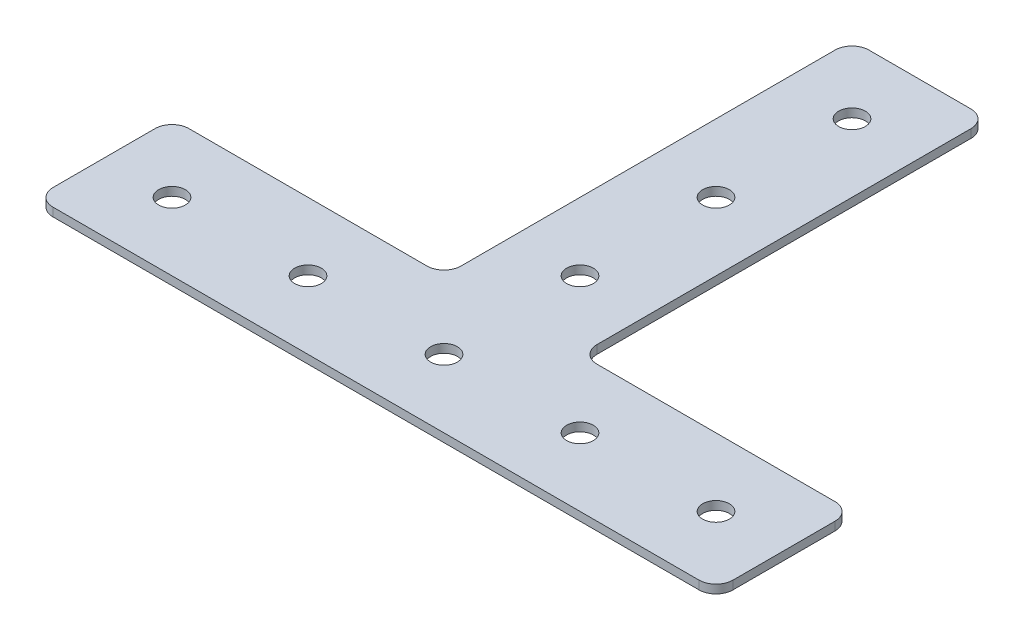
ISO-10303-21;
HEADER;
FILE_DESCRIPTION(('STEP AP214'),'2;1');
FILE_NAME('part.step','',(''),(''),'','','');
FILE_SCHEMA(('AUTOMOTIVE_DESIGN { 1 0 10303 214 1 1 1 1 }'));
ENDSEC;
DATA;
#1=APPLICATION_CONTEXT('core data for automotive mechanical design processes');
#2=APPLICATION_PROTOCOL_DEFINITION('international standard','automotive_design',2000,#1);
#3=PRODUCT_CONTEXT('',#1,'mechanical');
#4=PRODUCT('Part','Part','',(#3));
#5=PRODUCT_RELATED_PRODUCT_CATEGORY('part','',(#4));
#6=PRODUCT_DEFINITION_FORMATION('','',#4);
#7=PRODUCT_DEFINITION_CONTEXT('part definition',#1,'design');
#8=PRODUCT_DEFINITION('design','',#6,#7);
#9=PRODUCT_DEFINITION_SHAPE('','',#8);
#10=(LENGTH_UNIT() NAMED_UNIT(*) SI_UNIT(.MILLI.,.METRE.));
#11=(NAMED_UNIT(*) PLANE_ANGLE_UNIT() SI_UNIT($,.RADIAN.));
#12=(NAMED_UNIT(*) SI_UNIT($,.STERADIAN.) SOLID_ANGLE_UNIT());
#13=UNCERTAINTY_MEASURE_WITH_UNIT(LENGTH_MEASURE(1.E-05),#10,'distance_accuracy_value','');
#14=(GEOMETRIC_REPRESENTATION_CONTEXT(3) GLOBAL_UNCERTAINTY_ASSIGNED_CONTEXT((#13)) GLOBAL_UNIT_ASSIGNED_CONTEXT((#10,
#11,#12)) REPRESENTATION_CONTEXT('',''));
#15=CARTESIAN_POINT('',(0.,0.,0.));
#16=DIRECTION('',(0.,0.,1.));
#17=DIRECTION('',(1.,0.,0.));
#18=AXIS2_PLACEMENT_3D('',#15,#16,#17);
#19=CARTESIAN_POINT('',(63.5,1.5875,12.7));
#20=DIRECTION('',(-1.,0.,0.));
#21=DIRECTION('',(0.,0.,1.));
#22=AXIS2_PLACEMENT_3D('',#19,#20,#21);
#23=PLANE('',#22);
#24=DIRECTION('',(0.,0.,-1.));
#25=VECTOR('',#24,1.);
#26=CARTESIAN_POINT('',(63.5,1.5875,12.7));
#27=LINE('',#26,#25);
#28=CARTESIAN_POINT('',(63.5,1.5875,9.525));
#29=VERTEX_POINT('',#28);
#30=CARTESIAN_POINT('',(63.5,1.5875,-9.525));
#31=VERTEX_POINT('',#30);
#32=EDGE_CURVE('E170',#29,#31,#27,.T.);
#33=ORIENTED_EDGE('',*,*,#32,.F.);
#34=DIRECTION('',(0.,-1.,0.));
#35=VECTOR('',#34,1.);
#36=CARTESIAN_POINT('',(63.5,1.5875,9.525));
#37=LINE('',#36,#35);
#38=CARTESIAN_POINT('',(63.5,0.,9.525));
#39=VERTEX_POINT('',#38);
#40=EDGE_CURVE('E155',#29,#39,#37,.T.);
#41=ORIENTED_EDGE('',*,*,#40,.T.);
#42=DIRECTION('',(0.,0.,-1.));
#43=VECTOR('',#42,1.);
#44=CARTESIAN_POINT('',(63.5,0.,12.7));
#45=LINE('',#44,#43);
#46=CARTESIAN_POINT('',(63.5,0.,-9.525));
#47=VERTEX_POINT('',#46);
#48=EDGE_CURVE('E167',#39,#47,#45,.T.);
#49=ORIENTED_EDGE('',*,*,#48,.T.);
#50=DIRECTION('',(0.,-1.,0.));
#51=VECTOR('',#50,1.);
#52=CARTESIAN_POINT('',(63.5,1.5875,-9.525));
#53=LINE('',#52,#51);
#54=EDGE_CURVE('E172',#47,#31,#53,.F.);
#55=ORIENTED_EDGE('',*,*,#54,.T.);
#56=EDGE_LOOP('',(#33,#41,#49,#55));
#57=FACE_BOUND('',#56,.T.);
#58=ADVANCED_FACE('F37',(#57),#23,.F.);
#59=CARTESIAN_POINT('',(12.7,1.5875,-12.7));
#60=DIRECTION('',(0.,0.,1.));
#61=DIRECTION('',(1.,0.,0.));
#62=AXIS2_PLACEMENT_3D('',#59,#60,#61);
#63=PLANE('',#62);
#64=DIRECTION('',(-1.,0.,0.));
#65=VECTOR('',#64,1.);
#66=CARTESIAN_POINT('',(12.7,0.,-12.7));
#67=LINE('',#66,#65);
#68=CARTESIAN_POINT('',(60.325,0.,-12.7));
#69=VERTEX_POINT('',#68);
#70=CARTESIAN_POINT('',(15.875,0.,-12.7));
#71=VERTEX_POINT('',#70);
#72=EDGE_CURVE('E177',#69,#71,#67,.T.);
#73=ORIENTED_EDGE('',*,*,#72,.T.);
#74=DIRECTION('',(0.,-1.,0.));
#75=VECTOR('',#74,1.);
#76=CARTESIAN_POINT('',(15.875,1.5875,-12.7));
#77=LINE('',#76,#75);
#78=CARTESIAN_POINT('',(15.875,1.5875,-12.7));
#79=VERTEX_POINT('',#78);
#80=EDGE_CURVE('E254',#71,#79,#77,.F.);
#81=ORIENTED_EDGE('',*,*,#80,.T.);
#82=DIRECTION('',(-1.,0.,0.));
#83=VECTOR('',#82,1.);
#84=CARTESIAN_POINT('',(12.7,1.5875,-12.7));
#85=LINE('',#84,#83);
#86=CARTESIAN_POINT('',(60.325,1.5875,-12.7));
#87=VERTEX_POINT('',#86);
#88=EDGE_CURVE('E276',#87,#79,#85,.T.);
#89=ORIENTED_EDGE('',*,*,#88,.F.);
#90=DIRECTION('',(0.,-1.,0.));
#91=VECTOR('',#90,1.);
#92=CARTESIAN_POINT('',(60.325,1.5875,-12.7));
#93=LINE('',#92,#91);
#94=EDGE_CURVE('E251',#87,#69,#93,.T.);
#95=ORIENTED_EDGE('',*,*,#94,.T.);
#96=EDGE_LOOP('',(#73,#81,#89,#95));
#97=FACE_BOUND('',#96,.T.);
#98=ADVANCED_FACE('F264',(#97),#63,.F.);
#99=CARTESIAN_POINT('',(12.7,1.5875,-88.9));
#100=DIRECTION('',(-1.,0.,0.));
#101=DIRECTION('',(0.,0.,1.));
#102=AXIS2_PLACEMENT_3D('',#99,#100,#101);
#103=PLANE('',#102);
#104=DIRECTION('',(0.,0.,-1.));
#105=VECTOR('',#104,1.);
#106=CARTESIAN_POINT('',(12.7,0.,-88.9));
#107=LINE('',#106,#105);
#108=CARTESIAN_POINT('',(12.7,0.,-15.875));
#109=VERTEX_POINT('',#108);
#110=CARTESIAN_POINT('',(12.7,0.,-85.725));
#111=VERTEX_POINT('',#110);
#112=EDGE_CURVE('E181',#109,#111,#107,.T.);
#113=ORIENTED_EDGE('',*,*,#112,.T.);
#114=DIRECTION('',(0.,-1.,0.));
#115=VECTOR('',#114,1.);
#116=CARTESIAN_POINT('',(12.7,1.5875,-85.725));
#117=LINE('',#116,#115);
#118=CARTESIAN_POINT('',(12.7,1.5875,-85.725));
#119=VERTEX_POINT('',#118);
#120=EDGE_CURVE('E249',#111,#119,#117,.F.);
#121=ORIENTED_EDGE('',*,*,#120,.T.);
#122=DIRECTION('',(0.,0.,-1.));
#123=VECTOR('',#122,1.);
#124=CARTESIAN_POINT('',(12.7,1.5875,-88.9));
#125=LINE('',#124,#123);
#126=CARTESIAN_POINT('',(12.7,1.5875,-15.875));
#127=VERTEX_POINT('',#126);
#128=EDGE_CURVE('E274',#127,#119,#125,.T.);
#129=ORIENTED_EDGE('',*,*,#128,.F.);
#130=DIRECTION('',(0.,-1.,0.));
#131=VECTOR('',#130,1.);
#132=CARTESIAN_POINT('',(12.7,0.,-15.875));
#133=LINE('',#132,#131);
#134=EDGE_CURVE('E246',#127,#109,#133,.T.);
#135=ORIENTED_EDGE('',*,*,#134,.T.);
#136=EDGE_LOOP('',(#113,#121,#129,#135));
#137=FACE_BOUND('',#136,.T.);
#138=ADVANCED_FACE('F278',(#137),#103,.F.);
#139=CARTESIAN_POINT('',(-12.7,1.5875,-88.9));
#140=DIRECTION('',(0.,0.,1.));
#141=DIRECTION('',(1.,0.,0.));
#142=AXIS2_PLACEMENT_3D('',#139,#140,#141);
#143=PLANE('',#142);
#144=DIRECTION('',(-1.,0.,0.));
#145=VECTOR('',#144,1.);
#146=CARTESIAN_POINT('',(-12.7,0.,-88.9));
#147=LINE('',#146,#145);
#148=CARTESIAN_POINT('',(9.52499999999999,0.,-88.9));
#149=VERTEX_POINT('',#148);
#150=CARTESIAN_POINT('',(-9.52500000000001,0.,-88.9));
#151=VERTEX_POINT('',#150);
#152=EDGE_CURVE('E192',#149,#151,#147,.T.);
#153=ORIENTED_EDGE('',*,*,#152,.T.);
#154=DIRECTION('',(0.,-1.,0.));
#155=VECTOR('',#154,1.);
#156=CARTESIAN_POINT('',(-9.52500000000001,1.5875,-88.9));
#157=LINE('',#156,#155);
#158=CARTESIAN_POINT('',(-9.52500000000001,1.5875,-88.9));
#159=VERTEX_POINT('',#158);
#160=EDGE_CURVE('E244',#151,#159,#157,.F.);
#161=ORIENTED_EDGE('',*,*,#160,.T.);
#162=DIRECTION('',(-1.,0.,0.));
#163=VECTOR('',#162,1.);
#164=CARTESIAN_POINT('',(-12.7,1.5875,-88.9));
#165=LINE('',#164,#163);
#166=CARTESIAN_POINT('',(9.52499999999999,1.5875,-88.9));
#167=VERTEX_POINT('',#166);
#168=EDGE_CURVE('E280',#167,#159,#165,.T.);
#169=ORIENTED_EDGE('',*,*,#168,.F.);
#170=DIRECTION('',(0.,-1.,0.));
#171=VECTOR('',#170,1.);
#172=CARTESIAN_POINT('',(9.52499999999999,1.5875,-88.9));
#173=LINE('',#172,#171);
#174=EDGE_CURVE('E241',#167,#149,#173,.T.);
#175=ORIENTED_EDGE('',*,*,#174,.T.);
#176=EDGE_LOOP('',(#153,#161,#169,#175));
#177=FACE_BOUND('',#176,.T.);
#178=ADVANCED_FACE('F324',(#177),#143,.F.);
#179=CARTESIAN_POINT('',(-12.7,1.5875,-88.9));
#180=DIRECTION('',(1.,0.,0.));
#181=DIRECTION('',(0.,0.,-1.));
#182=AXIS2_PLACEMENT_3D('',#179,#180,#181);
#183=PLANE('',#182);
#184=DIRECTION('',(0.,0.,1.));
#185=VECTOR('',#184,1.);
#186=CARTESIAN_POINT('',(-12.7,0.,-88.9));
#187=LINE('',#186,#185);
#188=CARTESIAN_POINT('',(-12.7,0.,-85.725));
#189=VERTEX_POINT('',#188);
#190=CARTESIAN_POINT('',(-12.7,0.,-15.875));
#191=VERTEX_POINT('',#190);
#192=EDGE_CURVE('E195',#189,#191,#187,.T.);
#193=ORIENTED_EDGE('',*,*,#192,.T.);
#194=DIRECTION('',(0.,-1.,0.));
#195=VECTOR('',#194,1.);
#196=CARTESIAN_POINT('',(-12.7,1.5875,-15.875));
#197=LINE('',#196,#195);
#198=CARTESIAN_POINT('',(-12.7,1.5875,-15.875));
#199=VERTEX_POINT('',#198);
#200=EDGE_CURVE('E239',#191,#199,#197,.F.);
#201=ORIENTED_EDGE('',*,*,#200,.T.);
#202=DIRECTION('',(0.,0.,1.));
#203=VECTOR('',#202,1.);
#204=CARTESIAN_POINT('',(-12.7,1.5875,-88.9));
#205=LINE('',#204,#203);
#206=CARTESIAN_POINT('',(-12.7,1.5875,-85.725));
#207=VERTEX_POINT('',#206);
#208=EDGE_CURVE('E283',#207,#199,#205,.T.);
#209=ORIENTED_EDGE('',*,*,#208,.F.);
#210=DIRECTION('',(0.,-1.,0.));
#211=VECTOR('',#210,1.);
#212=CARTESIAN_POINT('',(-12.7,1.5875,-85.725));
#213=LINE('',#212,#211);
#214=EDGE_CURVE('E236',#207,#189,#213,.T.);
#215=ORIENTED_EDGE('',*,*,#214,.T.);
#216=EDGE_LOOP('',(#193,#201,#209,#215));
#217=FACE_BOUND('',#216,.T.);
#218=ADVANCED_FACE('F315',(#217),#183,.F.);
#219=CARTESIAN_POINT('',(-63.5,1.5875,-12.7));
#220=DIRECTION('',(0.,0.,1.));
#221=DIRECTION('',(1.,0.,0.));
#222=AXIS2_PLACEMENT_3D('',#219,#220,#221);
#223=PLANE('',#222);
#224=DIRECTION('',(-1.,0.,0.));
#225=VECTOR('',#224,1.);
#226=CARTESIAN_POINT('',(-63.5,1.5875,-12.7));
#227=LINE('',#226,#225);
#228=CARTESIAN_POINT('',(-15.875,1.5875,-12.7));
#229=VERTEX_POINT('',#228);
#230=CARTESIAN_POINT('',(-60.325,1.5875,-12.7));
#231=VERTEX_POINT('',#230);
#232=EDGE_CURVE('E290',#229,#231,#227,.T.);
#233=ORIENTED_EDGE('',*,*,#232,.F.);
#234=DIRECTION('',(0.,-1.,0.));
#235=VECTOR('',#234,1.);
#236=CARTESIAN_POINT('',(-15.875,0.,-12.7));
#237=LINE('',#236,#235);
#238=CARTESIAN_POINT('',(-15.875,0.,-12.7));
#239=VERTEX_POINT('',#238);
#240=EDGE_CURVE('E233',#229,#239,#237,.T.);
#241=ORIENTED_EDGE('',*,*,#240,.T.);
#242=DIRECTION('',(-1.,0.,0.));
#243=VECTOR('',#242,1.);
#244=CARTESIAN_POINT('',(-63.5,0.,-12.7));
#245=LINE('',#244,#243);
#246=CARTESIAN_POINT('',(-60.325,0.,-12.7));
#247=VERTEX_POINT('',#246);
#248=EDGE_CURVE('E198',#239,#247,#245,.T.);
#249=ORIENTED_EDGE('',*,*,#248,.T.);
#250=DIRECTION('',(0.,-1.,0.));
#251=VECTOR('',#250,1.);
#252=CARTESIAN_POINT('',(-60.325,1.5875,-12.7));
#253=LINE('',#252,#251);
#254=EDGE_CURVE('E231',#247,#231,#253,.F.);
#255=ORIENTED_EDGE('',*,*,#254,.T.);
#256=EDGE_LOOP('',(#233,#241,#249,#255));
#257=FACE_BOUND('',#256,.T.);
#258=ADVANCED_FACE('F307',(#257),#223,.F.);
#259=CARTESIAN_POINT('',(-63.5,1.5875,12.7));
#260=DIRECTION('',(1.,0.,0.));
#261=DIRECTION('',(0.,0.,-1.));
#262=AXIS2_PLACEMENT_3D('',#259,#260,#261);
#263=PLANE('',#262);
#264=DIRECTION('',(0.,0.,1.));
#265=VECTOR('',#264,1.);
#266=CARTESIAN_POINT('',(-63.5,0.,12.7));
#267=LINE('',#266,#265);
#268=CARTESIAN_POINT('',(-63.5,0.,-9.525));
#269=VERTEX_POINT('',#268);
#270=CARTESIAN_POINT('',(-63.5,0.,9.525));
#271=VERTEX_POINT('',#270);
#272=EDGE_CURVE('E201',#269,#271,#267,.T.);
#273=ORIENTED_EDGE('',*,*,#272,.T.);
#274=DIRECTION('',(0.,-1.,0.));
#275=VECTOR('',#274,1.);
#276=CARTESIAN_POINT('',(-63.5,1.5875,9.525));
#277=LINE('',#276,#275);
#278=CARTESIAN_POINT('',(-63.5,1.5875,9.525));
#279=VERTEX_POINT('',#278);
#280=EDGE_CURVE('E52',#271,#279,#277,.F.);
#281=ORIENTED_EDGE('',*,*,#280,.T.);
#282=DIRECTION('',(0.,0.,1.));
#283=VECTOR('',#282,1.);
#284=CARTESIAN_POINT('',(-63.5,1.5875,12.7));
#285=LINE('',#284,#283);
#286=CARTESIAN_POINT('',(-63.5,1.5875,-9.525));
#287=VERTEX_POINT('',#286);
#288=EDGE_CURVE('E291',#287,#279,#285,.T.);
#289=ORIENTED_EDGE('',*,*,#288,.F.);
#290=DIRECTION('',(0.,-1.,0.));
#291=VECTOR('',#290,1.);
#292=CARTESIAN_POINT('',(-63.5,1.5875,-9.525));
#293=LINE('',#292,#291);
#294=EDGE_CURVE('E227',#287,#269,#293,.T.);
#295=ORIENTED_EDGE('',*,*,#294,.T.);
#296=EDGE_LOOP('',(#273,#281,#289,#295));
#297=FACE_BOUND('',#296,.T.);
#298=ADVANCED_FACE('F300',(#297),#263,.F.);
#299=CARTESIAN_POINT('',(-63.5,1.5875,12.7));
#300=DIRECTION('',(0.,0.,-1.));
#301=DIRECTION('',(-1.,0.,0.));
#302=AXIS2_PLACEMENT_3D('',#299,#300,#301);
#303=PLANE('',#302);
#304=DIRECTION('',(1.,0.,0.));
#305=VECTOR('',#304,1.);
#306=CARTESIAN_POINT('',(-63.5,0.,12.7));
#307=LINE('',#306,#305);
#308=CARTESIAN_POINT('',(-60.325,0.,12.7));
#309=VERTEX_POINT('',#308);
#310=CARTESIAN_POINT('',(60.325,0.,12.7));
#311=VERTEX_POINT('',#310);
#312=EDGE_CURVE('E203',#309,#311,#307,.T.);
#313=ORIENTED_EDGE('',*,*,#312,.T.);
#314=DIRECTION('',(0.,-1.,0.));
#315=VECTOR('',#314,1.);
#316=CARTESIAN_POINT('',(60.325,1.5875,12.7));
#317=LINE('',#316,#315);
#318=CARTESIAN_POINT('',(60.325,1.5875,12.7));
#319=VERTEX_POINT('',#318);
#320=EDGE_CURVE('E156',#311,#319,#317,.F.);
#321=ORIENTED_EDGE('',*,*,#320,.T.);
#322=DIRECTION('',(1.,0.,0.));
#323=VECTOR('',#322,1.);
#324=CARTESIAN_POINT('',(-63.5,1.5875,12.7));
#325=LINE('',#324,#323);
#326=CARTESIAN_POINT('',(-60.325,1.5875,12.7));
#327=VERTEX_POINT('',#326);
#328=EDGE_CURVE('E187',#327,#319,#325,.T.);
#329=ORIENTED_EDGE('',*,*,#328,.F.);
#330=DIRECTION('',(0.,-1.,0.));
#331=VECTOR('',#330,1.);
#332=CARTESIAN_POINT('',(-60.325,1.5875,12.7));
#333=LINE('',#332,#331);
#334=EDGE_CURVE('E161',#327,#309,#333,.T.);
#335=ORIENTED_EDGE('',*,*,#334,.T.);
#336=EDGE_LOOP('',(#313,#321,#329,#335));
#337=FACE_BOUND('',#336,.T.);
#338=ADVANCED_FACE('F296',(#337),#303,.F.);
#339=CARTESIAN_POINT('',(0.,1.5875,0.));
#340=DIRECTION('',(0.,-1.,0.));
#341=DIRECTION('',(0.,0.,-1.));
#342=AXIS2_PLACEMENT_3D('',#339,#340,#341);
#343=PLANE('',#342);
#344=CARTESIAN_POINT('',(-25.4,1.5875,0.));
#345=DIRECTION('',(0.,-1.,0.));
#346=DIRECTION('',(0.,0.,-1.));
#347=AXIS2_PLACEMENT_3D('',#344,#345,#346);
#348=CIRCLE('',#347,2.4892);
#349=CARTESIAN_POINT('',(-25.4,1.5875,-2.4892));
#350=VERTEX_POINT('',#349);
#351=EDGE_CURVE('E178',#350,#350,#348,.T.);
#352=ORIENTED_EDGE('',*,*,#351,.T.);
#353=EDGE_LOOP('',(#352));
#354=FACE_BOUND('',#353,.T.);
#355=CARTESIAN_POINT('',(0.,1.5875,-76.2));
#356=DIRECTION('',(0.,-1.,0.));
#357=DIRECTION('',(0.,0.,-1.));
#358=AXIS2_PLACEMENT_3D('',#355,#356,#357);
#359=CIRCLE('',#358,2.4892);
#360=CARTESIAN_POINT('',(0.,1.5875,-78.6892));
#361=VERTEX_POINT('',#360);
#362=EDGE_CURVE('E184',#361,#361,#359,.T.);
#363=ORIENTED_EDGE('',*,*,#362,.T.);
#364=EDGE_LOOP('',(#363));
#365=FACE_BOUND('',#364,.T.);
#366=CARTESIAN_POINT('',(0.,1.5875,-50.8));
#367=DIRECTION('',(0.,-1.,0.));
#368=DIRECTION('',(0.,0.,-1.));
#369=AXIS2_PLACEMENT_3D('',#366,#367,#368);
#370=CIRCLE('',#369,2.4892);
#371=CARTESIAN_POINT('',(0.,1.5875,-53.2892));
#372=VERTEX_POINT('',#371);
#373=EDGE_CURVE('E393',#372,#372,#370,.T.);
#374=ORIENTED_EDGE('',*,*,#373,.T.);
#375=EDGE_LOOP('',(#374));
#376=FACE_BOUND('',#375,.T.);
#377=CARTESIAN_POINT('',(0.,1.5875,-25.4));
#378=DIRECTION('',(0.,-1.,0.));
#379=DIRECTION('',(0.,0.,-1.));
#380=AXIS2_PLACEMENT_3D('',#377,#378,#379);
#381=CIRCLE('',#380,2.4892);
#382=CARTESIAN_POINT('',(0.,1.5875,-27.8892));
#383=VERTEX_POINT('',#382);
#384=EDGE_CURVE('E396',#383,#383,#381,.T.);
#385=ORIENTED_EDGE('',*,*,#384,.T.);
#386=EDGE_LOOP('',(#385));
#387=FACE_BOUND('',#386,.T.);
#388=CARTESIAN_POINT('',(-50.8,1.5875,0.));
#389=DIRECTION('',(0.,-1.,0.));
#390=DIRECTION('',(0.,0.,-1.));
#391=AXIS2_PLACEMENT_3D('',#388,#389,#390);
#392=CIRCLE('',#391,2.4892);
#393=CARTESIAN_POINT('',(-50.8,1.5875,-2.48919999999999));
#394=VERTEX_POINT('',#393);
#395=EDGE_CURVE('E399',#394,#394,#392,.T.);
#396=ORIENTED_EDGE('',*,*,#395,.T.);
#397=EDGE_LOOP('',(#396));
#398=FACE_BOUND('',#397,.T.);
#399=CARTESIAN_POINT('',(25.4,1.5875,0.));
#400=DIRECTION('',(0.,-1.,0.));
#401=DIRECTION('',(0.,0.,-1.));
#402=AXIS2_PLACEMENT_3D('',#399,#400,#401);
#403=CIRCLE('',#402,2.4892);
#404=CARTESIAN_POINT('',(25.4,1.5875,-2.4892));
#405=VERTEX_POINT('',#404);
#406=EDGE_CURVE('E402',#405,#405,#403,.T.);
#407=ORIENTED_EDGE('',*,*,#406,.T.);
#408=EDGE_LOOP('',(#407));
#409=FACE_BOUND('',#408,.T.);
#410=CARTESIAN_POINT('',(50.8,1.5875,0.));
#411=DIRECTION('',(0.,-1.,0.));
#412=DIRECTION('',(0.,0.,-1.));
#413=AXIS2_PLACEMENT_3D('',#410,#411,#412);
#414=CIRCLE('',#413,2.4892);
#415=CARTESIAN_POINT('',(50.8,1.5875,-2.4892));
#416=VERTEX_POINT('',#415);
#417=EDGE_CURVE('E405',#416,#416,#414,.T.);
#418=ORIENTED_EDGE('',*,*,#417,.T.);
#419=EDGE_LOOP('',(#418));
#420=FACE_BOUND('',#419,.T.);
#421=CARTESIAN_POINT('',(0.,1.5875,0.));
#422=DIRECTION('',(0.,-1.,0.));
#423=DIRECTION('',(0.,0.,-1.));
#424=AXIS2_PLACEMENT_3D('',#421,#422,#423);
#425=CIRCLE('',#424,2.4892);
#426=CARTESIAN_POINT('',(0.,1.5875,-2.4892));
#427=VERTEX_POINT('',#426);
#428=EDGE_CURVE('E408',#427,#427,#425,.T.);
#429=ORIENTED_EDGE('',*,*,#428,.T.);
#430=EDGE_LOOP('',(#429));
#431=FACE_BOUND('',#430,.T.);
#432=ORIENTED_EDGE('',*,*,#328,.T.);
#433=CARTESIAN_POINT('',(60.325,1.5875,9.525));
#434=DIRECTION('',(0.,-1.,0.));
#435=DIRECTION('',(0.,0.,-1.));
#436=AXIS2_PLACEMENT_3D('',#433,#434,#435);
#437=CIRCLE('',#436,3.175);
#438=EDGE_CURVE('E225',#319,#29,#437,.F.);
#439=ORIENTED_EDGE('',*,*,#438,.T.);
#440=ORIENTED_EDGE('',*,*,#32,.T.);
#441=CARTESIAN_POINT('',(60.325,1.5875,-9.525));
#442=DIRECTION('',(0.,-1.,0.));
#443=DIRECTION('',(0.,0.,-1.));
#444=AXIS2_PLACEMENT_3D('',#441,#442,#443);
#445=CIRCLE('',#444,3.175);
#446=EDGE_CURVE('E217',#31,#87,#445,.F.);
#447=ORIENTED_EDGE('',*,*,#446,.T.);
#448=ORIENTED_EDGE('',*,*,#88,.T.);
#449=CARTESIAN_POINT('',(15.875,1.5875,-15.875));
#450=DIRECTION('',(0.,-1.,0.));
#451=DIRECTION('',(0.,0.,-1.));
#452=AXIS2_PLACEMENT_3D('',#449,#450,#451);
#453=CIRCLE('',#452,3.175);
#454=EDGE_CURVE('E11',#79,#127,#453,.T.);
#455=ORIENTED_EDGE('',*,*,#454,.T.);
#456=ORIENTED_EDGE('',*,*,#128,.T.);
#457=CARTESIAN_POINT('',(9.52499999999999,1.5875,-85.725));
#458=DIRECTION('',(0.,-1.,0.));
#459=DIRECTION('',(0.,0.,-1.));
#460=AXIS2_PLACEMENT_3D('',#457,#458,#459);
#461=CIRCLE('',#460,3.175);
#462=EDGE_CURVE('E219',#119,#167,#461,.F.);
#463=ORIENTED_EDGE('',*,*,#462,.T.);
#464=ORIENTED_EDGE('',*,*,#168,.T.);
#465=CARTESIAN_POINT('',(-9.52500000000001,1.5875,-85.725));
#466=DIRECTION('',(0.,-1.,0.));
#467=DIRECTION('',(0.,0.,-1.));
#468=AXIS2_PLACEMENT_3D('',#465,#466,#467);
#469=CIRCLE('',#468,3.175);
#470=EDGE_CURVE('E221',#159,#207,#469,.F.);
#471=ORIENTED_EDGE('',*,*,#470,.T.);
#472=ORIENTED_EDGE('',*,*,#208,.T.);
#473=CARTESIAN_POINT('',(-15.875,1.5875,-15.875));
#474=DIRECTION('',(0.,-1.,0.));
#475=DIRECTION('',(0.,0.,-1.));
#476=AXIS2_PLACEMENT_3D('',#473,#474,#475);
#477=CIRCLE('',#476,3.175);
#478=EDGE_CURVE('E258',#199,#229,#477,.T.);
#479=ORIENTED_EDGE('',*,*,#478,.T.);
#480=ORIENTED_EDGE('',*,*,#232,.T.);
#481=CARTESIAN_POINT('',(-60.325,1.5875,-9.525));
#482=DIRECTION('',(0.,-1.,0.));
#483=DIRECTION('',(0.,0.,-1.));
#484=AXIS2_PLACEMENT_3D('',#481,#482,#483);
#485=CIRCLE('',#484,3.175);
#486=EDGE_CURVE('E59',#231,#287,#485,.F.);
#487=ORIENTED_EDGE('',*,*,#486,.T.);
#488=ORIENTED_EDGE('',*,*,#288,.T.);
#489=CARTESIAN_POINT('',(-60.325,1.5875,9.525));
#490=DIRECTION('',(0.,-1.,0.));
#491=DIRECTION('',(0.,0.,-1.));
#492=AXIS2_PLACEMENT_3D('',#489,#490,#491);
#493=CIRCLE('',#492,3.175);
#494=EDGE_CURVE('E223',#279,#327,#493,.F.);
#495=ORIENTED_EDGE('',*,*,#494,.T.);
#496=EDGE_LOOP('',(#432,#439,#440,#447,#448,#455,#456,#463,#464,#471,#472,#479,#480,#487,#488,#495));
#497=FACE_BOUND('',#496,.T.);
#498=ADVANCED_FACE('F273',(#354,#365,#376,#387,#398,#409,#420,#431,#497),#343,.F.);
#499=CARTESIAN_POINT('',(0.,0.,0.));
#500=DIRECTION('',(0.,-1.,0.));
#501=DIRECTION('',(0.,0.,-1.));
#502=AXIS2_PLACEMENT_3D('',#499,#500,#501);
#503=PLANE('',#502);
#504=CARTESIAN_POINT('',(-25.4,0.,0.));
#505=DIRECTION('',(0.,1.,0.));
#506=DIRECTION('',(0.,0.,1.));
#507=AXIS2_PLACEMENT_3D('',#504,#505,#506);
#508=CIRCLE('',#507,2.4892);
#509=CARTESIAN_POINT('',(-25.4,0.,2.4892));
#510=VERTEX_POINT('',#509);
#511=EDGE_CURVE('E421',#510,#510,#508,.T.);
#512=ORIENTED_EDGE('',*,*,#511,.T.);
#513=EDGE_LOOP('',(#512));
#514=FACE_BOUND('',#513,.T.);
#515=CARTESIAN_POINT('',(0.,0.,-76.2));
#516=DIRECTION('',(0.,1.,0.));
#517=DIRECTION('',(0.,0.,1.));
#518=AXIS2_PLACEMENT_3D('',#515,#516,#517);
#519=CIRCLE('',#518,2.4892);
#520=CARTESIAN_POINT('',(0.,0.,-73.7108));
#521=VERTEX_POINT('',#520);
#522=EDGE_CURVE('E418',#521,#521,#519,.T.);
#523=ORIENTED_EDGE('',*,*,#522,.T.);
#524=EDGE_LOOP('',(#523));
#525=FACE_BOUND('',#524,.T.);
#526=CARTESIAN_POINT('',(0.,0.,-50.8));
#527=DIRECTION('',(0.,1.,0.));
#528=DIRECTION('',(0.,0.,1.));
#529=AXIS2_PLACEMENT_3D('',#526,#527,#528);
#530=CIRCLE('',#529,2.4892);
#531=CARTESIAN_POINT('',(0.,0.,-48.3108));
#532=VERTEX_POINT('',#531);
#533=EDGE_CURVE('E415',#532,#532,#530,.T.);
#534=ORIENTED_EDGE('',*,*,#533,.T.);
#535=EDGE_LOOP('',(#534));
#536=FACE_BOUND('',#535,.T.);
#537=CARTESIAN_POINT('',(0.,0.,-25.4));
#538=DIRECTION('',(0.,1.,0.));
#539=DIRECTION('',(0.,0.,1.));
#540=AXIS2_PLACEMENT_3D('',#537,#538,#539);
#541=CIRCLE('',#540,2.4892);
#542=CARTESIAN_POINT('',(0.,0.,-22.9108));
#543=VERTEX_POINT('',#542);
#544=EDGE_CURVE('E414',#543,#543,#541,.T.);
#545=ORIENTED_EDGE('',*,*,#544,.T.);
#546=EDGE_LOOP('',(#545));
#547=FACE_BOUND('',#546,.T.);
#548=CARTESIAN_POINT('',(-50.8,0.,0.));
#549=DIRECTION('',(0.,1.,0.));
#550=DIRECTION('',(0.,0.,1.));
#551=AXIS2_PLACEMENT_3D('',#548,#549,#550);
#552=CIRCLE('',#551,2.4892);
#553=CARTESIAN_POINT('',(-50.8,0.,2.4892));
#554=VERTEX_POINT('',#553);
#555=EDGE_CURVE('E424',#554,#554,#552,.T.);
#556=ORIENTED_EDGE('',*,*,#555,.T.);
#557=EDGE_LOOP('',(#556));
#558=FACE_BOUND('',#557,.T.);
#559=CARTESIAN_POINT('',(25.4,0.,0.));
#560=DIRECTION('',(0.,1.,0.));
#561=DIRECTION('',(0.,0.,1.));
#562=AXIS2_PLACEMENT_3D('',#559,#560,#561);
#563=CIRCLE('',#562,2.4892);
#564=CARTESIAN_POINT('',(25.4,0.,2.4892));
#565=VERTEX_POINT('',#564);
#566=EDGE_CURVE('E430',#565,#565,#563,.T.);
#567=ORIENTED_EDGE('',*,*,#566,.T.);
#568=EDGE_LOOP('',(#567));
#569=FACE_BOUND('',#568,.T.);
#570=CARTESIAN_POINT('',(50.8,0.,0.));
#571=DIRECTION('',(0.,1.,0.));
#572=DIRECTION('',(0.,0.,1.));
#573=AXIS2_PLACEMENT_3D('',#570,#571,#572);
#574=CIRCLE('',#573,2.4892);
#575=CARTESIAN_POINT('',(50.8,0.,2.4892));
#576=VERTEX_POINT('',#575);
#577=EDGE_CURVE('E427',#576,#576,#574,.T.);
#578=ORIENTED_EDGE('',*,*,#577,.T.);
#579=EDGE_LOOP('',(#578));
#580=FACE_BOUND('',#579,.T.);
#581=CARTESIAN_POINT('',(0.,0.,0.));
#582=DIRECTION('',(0.,1.,0.));
#583=DIRECTION('',(0.,0.,1.));
#584=AXIS2_PLACEMENT_3D('',#581,#582,#583);
#585=CIRCLE('',#584,2.4892);
#586=CARTESIAN_POINT('',(0.,0.,2.4892));
#587=VERTEX_POINT('',#586);
#588=EDGE_CURVE('E411',#587,#587,#585,.T.);
#589=ORIENTED_EDGE('',*,*,#588,.T.);
#590=EDGE_LOOP('',(#589));
#591=FACE_BOUND('',#590,.T.);
#592=ORIENTED_EDGE('',*,*,#48,.F.);
#593=CARTESIAN_POINT('',(60.325,0.,9.525));
#594=DIRECTION('',(0.,-1.,0.));
#595=DIRECTION('',(0.,0.,-1.));
#596=AXIS2_PLACEMENT_3D('',#593,#594,#595);
#597=CIRCLE('',#596,3.175);
#598=EDGE_CURVE('E151',#39,#311,#597,.T.);
#599=ORIENTED_EDGE('',*,*,#598,.T.);
#600=ORIENTED_EDGE('',*,*,#312,.F.);
#601=CARTESIAN_POINT('',(-60.325,0.,9.525));
#602=DIRECTION('',(0.,-1.,0.));
#603=DIRECTION('',(0.,0.,-1.));
#604=AXIS2_PLACEMENT_3D('',#601,#602,#603);
#605=CIRCLE('',#604,3.175);
#606=EDGE_CURVE('E162',#309,#271,#605,.T.);
#607=ORIENTED_EDGE('',*,*,#606,.T.);
#608=ORIENTED_EDGE('',*,*,#272,.F.);
#609=CARTESIAN_POINT('',(-60.325,0.,-9.525));
#610=DIRECTION('',(0.,-1.,0.));
#611=DIRECTION('',(0.,0.,-1.));
#612=AXIS2_PLACEMENT_3D('',#609,#610,#611);
#613=CIRCLE('',#612,3.175);
#614=EDGE_CURVE('E171',#269,#247,#613,.T.);
#615=ORIENTED_EDGE('',*,*,#614,.T.);
#616=ORIENTED_EDGE('',*,*,#248,.F.);
#617=CARTESIAN_POINT('',(-15.875,0.,-15.875));
#618=DIRECTION('',(0.,-1.,0.));
#619=DIRECTION('',(0.,0.,-1.));
#620=AXIS2_PLACEMENT_3D('',#617,#618,#619);
#621=CIRCLE('',#620,3.175);
#622=EDGE_CURVE('E256',#239,#191,#621,.F.);
#623=ORIENTED_EDGE('',*,*,#622,.T.);
#624=ORIENTED_EDGE('',*,*,#192,.F.);
#625=CARTESIAN_POINT('',(-9.52500000000001,0.,-85.725));
#626=DIRECTION('',(0.,-1.,0.));
#627=DIRECTION('',(0.,0.,-1.));
#628=AXIS2_PLACEMENT_3D('',#625,#626,#627);
#629=CIRCLE('',#628,3.175);
#630=EDGE_CURVE('E210',#189,#151,#629,.T.);
#631=ORIENTED_EDGE('',*,*,#630,.T.);
#632=ORIENTED_EDGE('',*,*,#152,.F.);
#633=CARTESIAN_POINT('',(9.52499999999999,0.,-85.725));
#634=DIRECTION('',(0.,-1.,0.));
#635=DIRECTION('',(0.,0.,-1.));
#636=AXIS2_PLACEMENT_3D('',#633,#634,#635);
#637=CIRCLE('',#636,3.175);
#638=EDGE_CURVE('E208',#149,#111,#637,.T.);
#639=ORIENTED_EDGE('',*,*,#638,.T.);
#640=ORIENTED_EDGE('',*,*,#112,.F.);
#641=CARTESIAN_POINT('',(15.875,0.,-15.875));
#642=DIRECTION('',(0.,-1.,0.));
#643=DIRECTION('',(0.,0.,-1.));
#644=AXIS2_PLACEMENT_3D('',#641,#642,#643);
#645=CIRCLE('',#644,3.175);
#646=EDGE_CURVE('E45',#109,#71,#645,.F.);
#647=ORIENTED_EDGE('',*,*,#646,.T.);
#648=ORIENTED_EDGE('',*,*,#72,.F.);
#649=CARTESIAN_POINT('',(60.325,0.,-9.525));
#650=DIRECTION('',(0.,-1.,0.));
#651=DIRECTION('',(0.,0.,-1.));
#652=AXIS2_PLACEMENT_3D('',#649,#650,#651);
#653=CIRCLE('',#652,3.175);
#654=EDGE_CURVE('E176',#69,#47,#653,.T.);
#655=ORIENTED_EDGE('',*,*,#654,.T.);
#656=EDGE_LOOP('',(#592,#599,#600,#607,#608,#615,#616,#623,#624,#631,#632,#639,#640,#647,#648,#655));
#657=FACE_BOUND('',#656,.T.);
#658=ADVANCED_FACE('F174',(#514,#525,#536,#547,#558,#569,#580,#591,#657),#503,.T.);
#659=CARTESIAN_POINT('',(0.,0.,0.));
#660=DIRECTION('',(0.,1.,0.));
#661=DIRECTION('',(0.,0.,1.));
#662=AXIS2_PLACEMENT_3D('',#659,#660,#661);
#663=CYLINDRICAL_SURFACE('',#662,2.4892);
#664=ORIENTED_EDGE('',*,*,#588,.F.);
#665=EDGE_LOOP('',(#664));
#666=FACE_BOUND('',#665,.T.);
#667=ORIENTED_EDGE('',*,*,#428,.F.);
#668=EDGE_LOOP('',(#667));
#669=FACE_BOUND('',#668,.T.);
#670=ADVANCED_FACE('F456',(#666,#669),#663,.F.);
#671=CARTESIAN_POINT('',(50.8,0.,0.));
#672=DIRECTION('',(0.,1.,0.));
#673=DIRECTION('',(0.,0.,1.));
#674=AXIS2_PLACEMENT_3D('',#671,#672,#673);
#675=CYLINDRICAL_SURFACE('',#674,2.4892);
#676=ORIENTED_EDGE('',*,*,#577,.F.);
#677=EDGE_LOOP('',(#676));
#678=FACE_BOUND('',#677,.T.);
#679=ORIENTED_EDGE('',*,*,#417,.F.);
#680=EDGE_LOOP('',(#679));
#681=FACE_BOUND('',#680,.T.);
#682=ADVANCED_FACE('F458',(#678,#681),#675,.F.);
#683=CARTESIAN_POINT('',(25.4,0.,0.));
#684=DIRECTION('',(0.,1.,0.));
#685=DIRECTION('',(0.,0.,1.));
#686=AXIS2_PLACEMENT_3D('',#683,#684,#685);
#687=CYLINDRICAL_SURFACE('',#686,2.4892);
#688=ORIENTED_EDGE('',*,*,#566,.F.);
#689=EDGE_LOOP('',(#688));
#690=FACE_BOUND('',#689,.T.);
#691=ORIENTED_EDGE('',*,*,#406,.F.);
#692=EDGE_LOOP('',(#691));
#693=FACE_BOUND('',#692,.T.);
#694=ADVANCED_FACE('F442',(#690,#693),#687,.F.);
#695=CARTESIAN_POINT('',(-50.8,0.,0.));
#696=DIRECTION('',(0.,1.,0.));
#697=DIRECTION('',(0.,0.,1.));
#698=AXIS2_PLACEMENT_3D('',#695,#696,#697);
#699=CYLINDRICAL_SURFACE('',#698,2.4892);
#700=ORIENTED_EDGE('',*,*,#555,.F.);
#701=EDGE_LOOP('',(#700));
#702=FACE_BOUND('',#701,.T.);
#703=ORIENTED_EDGE('',*,*,#395,.F.);
#704=EDGE_LOOP('',(#703));
#705=FACE_BOUND('',#704,.T.);
#706=ADVANCED_FACE('F438',(#702,#705),#699,.F.);
#707=CARTESIAN_POINT('',(0.,0.,-25.4));
#708=DIRECTION('',(0.,1.,0.));
#709=DIRECTION('',(0.,0.,1.));
#710=AXIS2_PLACEMENT_3D('',#707,#708,#709);
#711=CYLINDRICAL_SURFACE('',#710,2.4892);
#712=ORIENTED_EDGE('',*,*,#544,.F.);
#713=EDGE_LOOP('',(#712));
#714=FACE_BOUND('',#713,.T.);
#715=ORIENTED_EDGE('',*,*,#384,.F.);
#716=EDGE_LOOP('',(#715));
#717=FACE_BOUND('',#716,.T.);
#718=ADVANCED_FACE('F441',(#714,#717),#711,.F.);
#719=CARTESIAN_POINT('',(0.,0.,-50.8));
#720=DIRECTION('',(0.,1.,0.));
#721=DIRECTION('',(0.,0.,1.));
#722=AXIS2_PLACEMENT_3D('',#719,#720,#721);
#723=CYLINDRICAL_SURFACE('',#722,2.4892);
#724=ORIENTED_EDGE('',*,*,#533,.F.);
#725=EDGE_LOOP('',(#724));
#726=FACE_BOUND('',#725,.T.);
#727=ORIENTED_EDGE('',*,*,#373,.F.);
#728=EDGE_LOOP('',(#727));
#729=FACE_BOUND('',#728,.T.);
#730=ADVANCED_FACE('F471',(#726,#729),#723,.F.);
#731=CARTESIAN_POINT('',(0.,0.,-76.2));
#732=DIRECTION('',(0.,1.,0.));
#733=DIRECTION('',(0.,0.,1.));
#734=AXIS2_PLACEMENT_3D('',#731,#732,#733);
#735=CYLINDRICAL_SURFACE('',#734,2.4892);
#736=ORIENTED_EDGE('',*,*,#522,.F.);
#737=EDGE_LOOP('',(#736));
#738=FACE_BOUND('',#737,.T.);
#739=ORIENTED_EDGE('',*,*,#362,.F.);
#740=EDGE_LOOP('',(#739));
#741=FACE_BOUND('',#740,.T.);
#742=ADVANCED_FACE('F538',(#738,#741),#735,.F.);
#743=CARTESIAN_POINT('',(-25.4,0.,0.));
#744=DIRECTION('',(0.,1.,0.));
#745=DIRECTION('',(0.,0.,1.));
#746=AXIS2_PLACEMENT_3D('',#743,#744,#745);
#747=CYLINDRICAL_SURFACE('',#746,2.4892);
#748=ORIENTED_EDGE('',*,*,#511,.F.);
#749=EDGE_LOOP('',(#748));
#750=FACE_BOUND('',#749,.T.);
#751=ORIENTED_EDGE('',*,*,#351,.F.);
#752=EDGE_LOOP('',(#751));
#753=FACE_BOUND('',#752,.T.);
#754=ADVANCED_FACE('F348',(#750,#753),#747,.F.);
#755=CARTESIAN_POINT('',(60.325,1.5875,9.525));
#756=DIRECTION('',(0.,-1.,0.));
#757=DIRECTION('',(0.,0.,-1.));
#758=AXIS2_PLACEMENT_3D('',#755,#756,#757);
#759=CYLINDRICAL_SURFACE('',#758,3.175);
#760=ORIENTED_EDGE('',*,*,#438,.F.);
#761=ORIENTED_EDGE('',*,*,#320,.F.);
#762=ORIENTED_EDGE('',*,*,#598,.F.);
#763=ORIENTED_EDGE('',*,*,#40,.F.);
#764=EDGE_LOOP('',(#760,#761,#762,#763));
#765=FACE_BOUND('',#764,.T.);
#766=ADVANCED_FACE('F154',(#765),#759,.T.);
#767=CARTESIAN_POINT('',(-60.325,1.5875,9.525));
#768=DIRECTION('',(0.,-1.,0.));
#769=DIRECTION('',(0.,0.,-1.));
#770=AXIS2_PLACEMENT_3D('',#767,#768,#769);
#771=CYLINDRICAL_SURFACE('',#770,3.175);
#772=ORIENTED_EDGE('',*,*,#494,.F.);
#773=ORIENTED_EDGE('',*,*,#280,.F.);
#774=ORIENTED_EDGE('',*,*,#606,.F.);
#775=ORIENTED_EDGE('',*,*,#334,.F.);
#776=EDGE_LOOP('',(#772,#773,#774,#775));
#777=FACE_BOUND('',#776,.T.);
#778=ADVANCED_FACE('F298',(#777),#771,.T.);
#779=CARTESIAN_POINT('',(-15.875,1.5875,-15.875));
#780=DIRECTION('',(0.,1.,0.));
#781=DIRECTION('',(0.,0.,1.));
#782=AXIS2_PLACEMENT_3D('',#779,#780,#781);
#783=CYLINDRICAL_SURFACE('',#782,3.175);
#784=ORIENTED_EDGE('',*,*,#478,.F.);
#785=ORIENTED_EDGE('',*,*,#200,.F.);
#786=ORIENTED_EDGE('',*,*,#622,.F.);
#787=ORIENTED_EDGE('',*,*,#240,.F.);
#788=EDGE_LOOP('',(#784,#785,#786,#787));
#789=FACE_BOUND('',#788,.T.);
#790=ADVANCED_FACE('F311',(#789),#783,.F.);
#791=CARTESIAN_POINT('',(-9.52500000000001,1.5875,-85.725));
#792=DIRECTION('',(0.,-1.,0.));
#793=DIRECTION('',(0.,0.,-1.));
#794=AXIS2_PLACEMENT_3D('',#791,#792,#793);
#795=CYLINDRICAL_SURFACE('',#794,3.175);
#796=ORIENTED_EDGE('',*,*,#470,.F.);
#797=ORIENTED_EDGE('',*,*,#160,.F.);
#798=ORIENTED_EDGE('',*,*,#630,.F.);
#799=ORIENTED_EDGE('',*,*,#214,.F.);
#800=EDGE_LOOP('',(#796,#797,#798,#799));
#801=FACE_BOUND('',#800,.T.);
#802=ADVANCED_FACE('F320',(#801),#795,.T.);
#803=CARTESIAN_POINT('',(9.52499999999999,1.5875,-85.725));
#804=DIRECTION('',(0.,-1.,0.));
#805=DIRECTION('',(0.,0.,-1.));
#806=AXIS2_PLACEMENT_3D('',#803,#804,#805);
#807=CYLINDRICAL_SURFACE('',#806,3.175);
#808=ORIENTED_EDGE('',*,*,#462,.F.);
#809=ORIENTED_EDGE('',*,*,#120,.F.);
#810=ORIENTED_EDGE('',*,*,#638,.F.);
#811=ORIENTED_EDGE('',*,*,#174,.F.);
#812=EDGE_LOOP('',(#808,#809,#810,#811));
#813=FACE_BOUND('',#812,.T.);
#814=ADVANCED_FACE('F328',(#813),#807,.T.);
#815=CARTESIAN_POINT('',(15.875,1.5875,-15.875));
#816=DIRECTION('',(0.,1.,0.));
#817=DIRECTION('',(0.,0.,1.));
#818=AXIS2_PLACEMENT_3D('',#815,#816,#817);
#819=CYLINDRICAL_SURFACE('',#818,3.175);
#820=ORIENTED_EDGE('',*,*,#454,.F.);
#821=ORIENTED_EDGE('',*,*,#80,.F.);
#822=ORIENTED_EDGE('',*,*,#646,.F.);
#823=ORIENTED_EDGE('',*,*,#134,.F.);
#824=EDGE_LOOP('',(#820,#821,#822,#823));
#825=FACE_BOUND('',#824,.T.);
#826=ADVANCED_FACE('F269',(#825),#819,.F.);
#827=CARTESIAN_POINT('',(60.325,1.5875,-9.525));
#828=DIRECTION('',(0.,-1.,0.));
#829=DIRECTION('',(0.,0.,-1.));
#830=AXIS2_PLACEMENT_3D('',#827,#828,#829);
#831=CYLINDRICAL_SURFACE('',#830,3.175);
#832=ORIENTED_EDGE('',*,*,#446,.F.);
#833=ORIENTED_EDGE('',*,*,#54,.F.);
#834=ORIENTED_EDGE('',*,*,#654,.F.);
#835=ORIENTED_EDGE('',*,*,#94,.F.);
#836=EDGE_LOOP('',(#832,#833,#834,#835));
#837=FACE_BOUND('',#836,.T.);
#838=ADVANCED_FACE('F335',(#837),#831,.T.);
#839=CARTESIAN_POINT('',(-60.325,1.5875,-9.525));
#840=DIRECTION('',(0.,-1.,0.));
#841=DIRECTION('',(0.,0.,-1.));
#842=AXIS2_PLACEMENT_3D('',#839,#840,#841);
#843=CYLINDRICAL_SURFACE('',#842,3.175);
#844=ORIENTED_EDGE('',*,*,#486,.F.);
#845=ORIENTED_EDGE('',*,*,#254,.F.);
#846=ORIENTED_EDGE('',*,*,#614,.F.);
#847=ORIENTED_EDGE('',*,*,#294,.F.);
#848=EDGE_LOOP('',(#844,#845,#846,#847));
#849=FACE_BOUND('',#848,.T.);
#850=ADVANCED_FACE('F39',(#849),#843,.T.);
#851=CLOSED_SHELL('',(#58,#98,#138,#178,#218,#258,#298,#338,#498,#658,#670,#682,#694,#706,#718,
#730,#742,#754,#766,#778,#790,#802,#814,#826,#838,#850));
#852=MANIFOLD_SOLID_BREP('B2',#851);
#853=ADVANCED_BREP_SHAPE_REPRESENTATION('',(#18,#852),#14);
#854=SHAPE_DEFINITION_REPRESENTATION(#9,#853);
ENDSEC;
END-ISO-10303-21;
